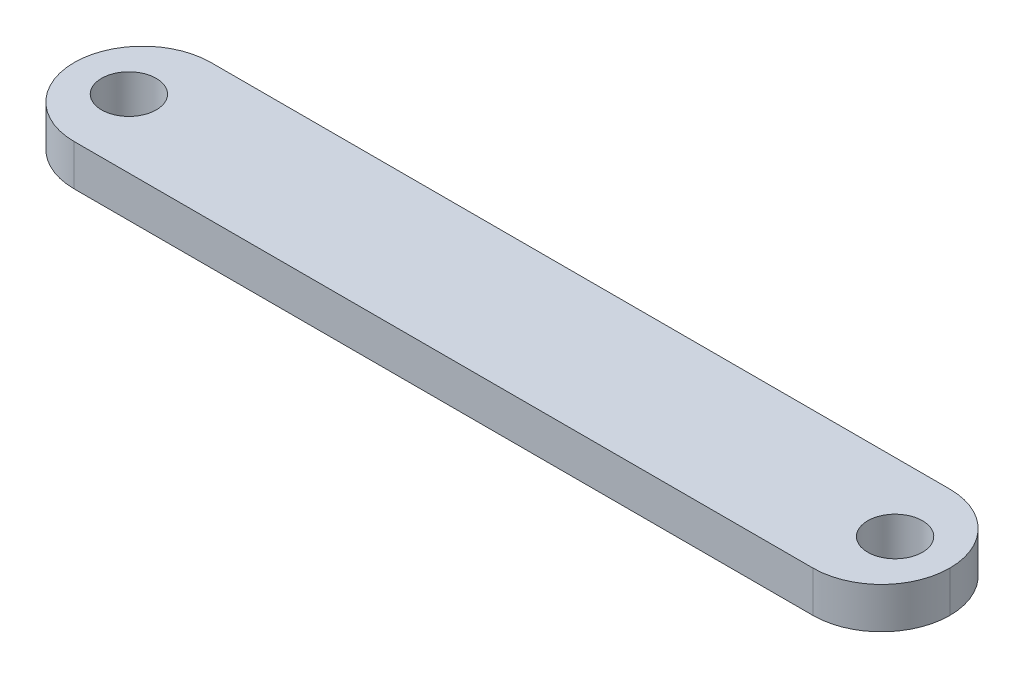
ISO-10303-21;
HEADER;
FILE_DESCRIPTION(('STEP AP214'),'2;1');
FILE_NAME('part.step','',(''),(''),'','','');
FILE_SCHEMA(('AUTOMOTIVE_DESIGN { 1 0 10303 214 1 1 1 1 }'));
ENDSEC;
DATA;
#1=APPLICATION_CONTEXT('core data for automotive mechanical design processes');
#2=APPLICATION_PROTOCOL_DEFINITION('international standard','automotive_design',2000,#1);
#3=PRODUCT_CONTEXT('',#1,'mechanical');
#4=PRODUCT('Part','Part','',(#3));
#5=PRODUCT_RELATED_PRODUCT_CATEGORY('part','',(#4));
#6=PRODUCT_DEFINITION_FORMATION('','',#4);
#7=PRODUCT_DEFINITION_CONTEXT('part definition',#1,'design');
#8=PRODUCT_DEFINITION('design','',#6,#7);
#9=PRODUCT_DEFINITION_SHAPE('','',#8);
#10=(LENGTH_UNIT() NAMED_UNIT(*) SI_UNIT(.MILLI.,.METRE.));
#11=(NAMED_UNIT(*) PLANE_ANGLE_UNIT() SI_UNIT($,.RADIAN.));
#12=(NAMED_UNIT(*) SI_UNIT($,.STERADIAN.) SOLID_ANGLE_UNIT());
#13=UNCERTAINTY_MEASURE_WITH_UNIT(LENGTH_MEASURE(1.E-05),#10,'distance_accuracy_value','');
#14=(GEOMETRIC_REPRESENTATION_CONTEXT(3) GLOBAL_UNCERTAINTY_ASSIGNED_CONTEXT((#13)) GLOBAL_UNIT_ASSIGNED_CONTEXT((#10,
#11,#12)) REPRESENTATION_CONTEXT('',''));
#15=CARTESIAN_POINT('',(0.,0.,0.));
#16=DIRECTION('',(0.,0.,1.));
#17=DIRECTION('',(1.,0.,0.));
#18=AXIS2_PLACEMENT_3D('',#15,#16,#17);
#19=CARTESIAN_POINT('',(0.,9.525,0.));
#20=DIRECTION('',(0.,-1.,0.));
#21=DIRECTION('',(0.,0.,-1.));
#22=AXIS2_PLACEMENT_3D('',#19,#20,#21);
#23=PLANE('',#22);
#24=CARTESIAN_POINT('',(187.325,9.525,-15.875));
#25=DIRECTION('',(0.,-1.,0.));
#26=DIRECTION('',(0.,0.,-1.));
#27=AXIS2_PLACEMENT_3D('',#24,#25,#26);
#28=CIRCLE('',#27,15.875);
#29=CARTESIAN_POINT('',(187.325,9.525,0.));
#30=VERTEX_POINT('',#29);
#31=CARTESIAN_POINT('',(203.2,9.525,-15.875));
#32=VERTEX_POINT('',#31);
#33=EDGE_CURVE('E57',#30,#32,#28,.F.);
#34=ORIENTED_EDGE('',*,*,#33,.T.);
#35=CARTESIAN_POINT('',(187.325,9.525,-15.875));
#36=DIRECTION('',(0.,-1.,0.));
#37=DIRECTION('',(0.,0.,-1.));
#38=AXIS2_PLACEMENT_3D('',#35,#36,#37);
#39=CIRCLE('',#38,15.875);
#40=CARTESIAN_POINT('',(187.325,9.525,-31.75));
#41=VERTEX_POINT('',#40);
#42=EDGE_CURVE('E151',#32,#41,#39,.F.);
#43=ORIENTED_EDGE('',*,*,#42,.T.);
#44=DIRECTION('',(-1.,0.,0.));
#45=VECTOR('',#44,1.);
#46=CARTESIAN_POINT('',(0.,9.525,-31.7499999999999));
#47=LINE('',#46,#45);
#48=CARTESIAN_POINT('',(15.875,9.525,-31.7499999999999));
#49=VERTEX_POINT('',#48);
#50=EDGE_CURVE('E116',#41,#49,#47,.T.);
#51=ORIENTED_EDGE('',*,*,#50,.T.);
#52=CARTESIAN_POINT('',(15.875,9.525,-15.8749999999999));
#53=DIRECTION('',(0.,-1.,0.));
#54=DIRECTION('',(0.,0.,-1.));
#55=AXIS2_PLACEMENT_3D('',#52,#53,#54);
#56=CIRCLE('',#55,15.875);
#57=CARTESIAN_POINT('',(0.,9.525,-15.875));
#58=VERTEX_POINT('',#57);
#59=EDGE_CURVE('E146',#49,#58,#56,.F.);
#60=ORIENTED_EDGE('',*,*,#59,.T.);
#61=CARTESIAN_POINT('',(15.875,9.525,-15.875));
#62=DIRECTION('',(0.,-1.,0.));
#63=DIRECTION('',(0.,0.,-1.));
#64=AXIS2_PLACEMENT_3D('',#61,#62,#63);
#65=CIRCLE('',#64,15.875);
#66=CARTESIAN_POINT('',(15.875,9.525,0.));
#67=VERTEX_POINT('',#66);
#68=EDGE_CURVE('E105',#58,#67,#65,.F.);
#69=ORIENTED_EDGE('',*,*,#68,.T.);
#70=DIRECTION('',(1.,0.,0.));
#71=VECTOR('',#70,1.);
#72=CARTESIAN_POINT('',(0.,9.525,0.));
#73=LINE('',#72,#71);
#74=EDGE_CURVE('E126',#67,#30,#73,.T.);
#75=ORIENTED_EDGE('',*,*,#74,.T.);
#76=EDGE_LOOP('',(#34,#43,#51,#60,#69,#75));
#77=FACE_BOUND('',#76,.T.);
#78=CARTESIAN_POINT('',(12.7,9.525,-15.875));
#79=DIRECTION('',(0.,1.,0.));
#80=DIRECTION('',(0.,0.,1.));
#81=AXIS2_PLACEMENT_3D('',#78,#79,#80);
#82=CIRCLE('',#81,6.35);
#83=CARTESIAN_POINT('',(12.7,9.525,-22.225));
#84=VERTEX_POINT('',#83);
#85=EDGE_CURVE('E132',#84,#84,#82,.T.);
#86=ORIENTED_EDGE('',*,*,#85,.F.);
#87=EDGE_LOOP('',(#86));
#88=FACE_BOUND('',#87,.T.);
#89=CARTESIAN_POINT('',(190.5,9.525,-15.875));
#90=DIRECTION('',(0.,1.,0.));
#91=DIRECTION('',(0.,0.,1.));
#92=AXIS2_PLACEMENT_3D('',#89,#90,#91);
#93=CIRCLE('',#92,6.35);
#94=CARTESIAN_POINT('',(190.5,9.525,-22.225));
#95=VERTEX_POINT('',#94);
#96=EDGE_CURVE('E160',#95,#95,#93,.T.);
#97=ORIENTED_EDGE('',*,*,#96,.F.);
#98=EDGE_LOOP('',(#97));
#99=FACE_BOUND('',#98,.T.);
#100=ADVANCED_FACE('F39',(#77,#88,#99),#23,.F.);
#101=CARTESIAN_POINT('',(0.,0.,0.));
#102=DIRECTION('',(0.,-1.,0.));
#103=DIRECTION('',(0.,0.,-1.));
#104=AXIS2_PLACEMENT_3D('',#101,#102,#103);
#105=PLANE('',#104);
#106=CARTESIAN_POINT('',(12.7,0.,-15.875));
#107=DIRECTION('',(0.,1.,0.));
#108=DIRECTION('',(0.,0.,1.));
#109=AXIS2_PLACEMENT_3D('',#106,#107,#108);
#110=CIRCLE('',#109,6.35);
#111=CARTESIAN_POINT('',(12.7,0.,-22.225));
#112=VERTEX_POINT('',#111);
#113=EDGE_CURVE('E177',#112,#112,#110,.T.);
#114=ORIENTED_EDGE('',*,*,#113,.T.);
#115=EDGE_LOOP('',(#114));
#116=FACE_BOUND('',#115,.T.);
#117=DIRECTION('',(-1.,0.,0.));
#118=VECTOR('',#117,1.);
#119=CARTESIAN_POINT('',(0.,0.,-31.7499999999999));
#120=LINE('',#119,#118);
#121=CARTESIAN_POINT('',(187.325,0.,-31.75));
#122=VERTEX_POINT('',#121);
#123=CARTESIAN_POINT('',(15.875,0.,-31.7499999999999));
#124=VERTEX_POINT('',#123);
#125=EDGE_CURVE('E113',#122,#124,#120,.T.);
#126=ORIENTED_EDGE('',*,*,#125,.F.);
#127=CARTESIAN_POINT('',(187.325,0.,-15.875));
#128=DIRECTION('',(0.,-1.,0.));
#129=DIRECTION('',(0.,0.,-1.));
#130=AXIS2_PLACEMENT_3D('',#127,#128,#129);
#131=CIRCLE('',#130,15.875);
#132=CARTESIAN_POINT('',(203.2,0.,-15.875));
#133=VERTEX_POINT('',#132);
#134=EDGE_CURVE('E95',#122,#133,#131,.T.);
#135=ORIENTED_EDGE('',*,*,#134,.T.);
#136=CARTESIAN_POINT('',(187.325,0.,-15.875));
#137=DIRECTION('',(0.,-1.,0.));
#138=DIRECTION('',(0.,0.,-1.));
#139=AXIS2_PLACEMENT_3D('',#136,#137,#138);
#140=CIRCLE('',#139,15.875);
#141=CARTESIAN_POINT('',(187.325,0.,0.));
#142=VERTEX_POINT('',#141);
#143=EDGE_CURVE('E106',#133,#142,#140,.T.);
#144=ORIENTED_EDGE('',*,*,#143,.T.);
#145=DIRECTION('',(1.,0.,0.));
#146=VECTOR('',#145,1.);
#147=CARTESIAN_POINT('',(0.,0.,0.));
#148=LINE('',#147,#146);
#149=CARTESIAN_POINT('',(15.875,0.,0.));
#150=VERTEX_POINT('',#149);
#151=EDGE_CURVE('E127',#150,#142,#148,.T.);
#152=ORIENTED_EDGE('',*,*,#151,.F.);
#153=CARTESIAN_POINT('',(15.875,0.,-15.875));
#154=DIRECTION('',(0.,-1.,0.));
#155=DIRECTION('',(0.,0.,-1.));
#156=AXIS2_PLACEMENT_3D('',#153,#154,#155);
#157=CIRCLE('',#156,15.875);
#158=CARTESIAN_POINT('',(0.,0.,-15.875));
#159=VERTEX_POINT('',#158);
#160=EDGE_CURVE('E118',#150,#159,#157,.T.);
#161=ORIENTED_EDGE('',*,*,#160,.T.);
#162=CARTESIAN_POINT('',(15.875,0.,-15.8749999999999));
#163=DIRECTION('',(0.,-1.,0.));
#164=DIRECTION('',(0.,0.,-1.));
#165=AXIS2_PLACEMENT_3D('',#162,#163,#164);
#166=CIRCLE('',#165,15.875);
#167=EDGE_CURVE('E124',#159,#124,#166,.T.);
#168=ORIENTED_EDGE('',*,*,#167,.T.);
#169=EDGE_LOOP('',(#126,#135,#144,#152,#161,#168));
#170=FACE_BOUND('',#169,.T.);
#171=CARTESIAN_POINT('',(190.5,0.,-15.875));
#172=DIRECTION('',(0.,1.,0.));
#173=DIRECTION('',(0.,0.,1.));
#174=AXIS2_PLACEMENT_3D('',#171,#172,#173);
#175=CIRCLE('',#174,6.35);
#176=CARTESIAN_POINT('',(190.5,0.,-22.225));
#177=VERTEX_POINT('',#176);
#178=EDGE_CURVE('E156',#177,#177,#175,.T.);
#179=ORIENTED_EDGE('',*,*,#178,.T.);
#180=EDGE_LOOP('',(#179));
#181=FACE_BOUND('',#180,.T.);
#182=ADVANCED_FACE('F121',(#116,#170,#181),#105,.T.);
#183=CARTESIAN_POINT('',(0.,9.525,0.));
#184=DIRECTION('',(0.,0.,-1.));
#185=DIRECTION('',(-1.,0.,0.));
#186=AXIS2_PLACEMENT_3D('',#183,#184,#185);
#187=PLANE('',#186);
#188=ORIENTED_EDGE('',*,*,#151,.T.);
#189=DIRECTION('',(0.,-1.,0.));
#190=VECTOR('',#189,1.);
#191=CARTESIAN_POINT('',(187.325,9.525,0.));
#192=LINE('',#191,#190);
#193=EDGE_CURVE('E11',#142,#30,#192,.F.);
#194=ORIENTED_EDGE('',*,*,#193,.T.);
#195=ORIENTED_EDGE('',*,*,#74,.F.);
#196=DIRECTION('',(0.,-1.,0.));
#197=VECTOR('',#196,1.);
#198=CARTESIAN_POINT('',(15.875,9.525,0.));
#199=LINE('',#198,#197);
#200=EDGE_CURVE('E49',#67,#150,#199,.T.);
#201=ORIENTED_EDGE('',*,*,#200,.T.);
#202=EDGE_LOOP('',(#188,#194,#195,#201));
#203=FACE_BOUND('',#202,.T.);
#204=ADVANCED_FACE('F171',(#203),#187,.F.);
#205=CARTESIAN_POINT('',(0.,9.525,-31.7499999999999));
#206=DIRECTION('',(0.,0.,1.));
#207=DIRECTION('',(1.,0.,0.));
#208=AXIS2_PLACEMENT_3D('',#205,#206,#207);
#209=PLANE('',#208);
#210=ORIENTED_EDGE('',*,*,#50,.F.);
#211=DIRECTION('',(0.,-1.,0.));
#212=VECTOR('',#211,1.);
#213=CARTESIAN_POINT('',(187.325,9.525,-31.75));
#214=LINE('',#213,#212);
#215=EDGE_CURVE('E99',#41,#122,#214,.T.);
#216=ORIENTED_EDGE('',*,*,#215,.T.);
#217=ORIENTED_EDGE('',*,*,#125,.T.);
#218=DIRECTION('',(0.,-1.,0.));
#219=VECTOR('',#218,1.);
#220=CARTESIAN_POINT('',(15.875,9.525,-31.7499999999999));
#221=LINE('',#220,#219);
#222=EDGE_CURVE('E119',#124,#49,#221,.F.);
#223=ORIENTED_EDGE('',*,*,#222,.T.);
#224=EDGE_LOOP('',(#210,#216,#217,#223));
#225=FACE_BOUND('',#224,.T.);
#226=ADVANCED_FACE('F111',(#225),#209,.F.);
#227=CARTESIAN_POINT('',(12.7,9.525,-15.875));
#228=DIRECTION('',(0.,-1.,0.));
#229=DIRECTION('',(0.,0.,-1.));
#230=AXIS2_PLACEMENT_3D('',#227,#228,#229);
#231=CYLINDRICAL_SURFACE('',#230,6.35);
#232=CARTESIAN_POINT('',(12.7,9.525,-22.225));
#233=CARTESIAN_POINT('',(12.7,9.42578125,-22.225));
#234=CARTESIAN_POINT('',(12.7,9.3265625,-22.225));
#235=CARTESIAN_POINT('',(12.7,9.128125,-22.225));
#236=CARTESIAN_POINT('',(12.7,9.02890625,-22.225));
#237=CARTESIAN_POINT('',(12.7,8.83046875,-22.225));
#238=CARTESIAN_POINT('',(12.7,8.73125,-22.225));
#239=CARTESIAN_POINT('',(12.7,8.5328125,-22.225));
#240=CARTESIAN_POINT('',(12.7,8.43359375,-22.225));
#241=CARTESIAN_POINT('',(12.7,8.23515625,-22.225));
#242=CARTESIAN_POINT('',(12.7,8.1359375,-22.225));
#243=CARTESIAN_POINT('',(12.7,7.9375,-22.225));
#244=CARTESIAN_POINT('',(12.7,7.83828125,-22.225));
#245=CARTESIAN_POINT('',(12.7,7.63984375,-22.225));
#246=CARTESIAN_POINT('',(12.7,7.540625,-22.225));
#247=CARTESIAN_POINT('',(12.7,7.3421875,-22.225));
#248=CARTESIAN_POINT('',(12.7,7.24296875,-22.225));
#249=CARTESIAN_POINT('',(12.7,7.04453125,-22.225));
#250=CARTESIAN_POINT('',(12.7,6.9453125,-22.225));
#251=CARTESIAN_POINT('',(12.7,6.746875,-22.225));
#252=CARTESIAN_POINT('',(12.7,6.64765625,-22.225));
#253=CARTESIAN_POINT('',(12.7,6.44921875,-22.225));
#254=CARTESIAN_POINT('',(12.7,6.35,-22.225));
#255=CARTESIAN_POINT('',(12.7,6.1515625,-22.225));
#256=CARTESIAN_POINT('',(12.7,6.05234375,-22.225));
#257=CARTESIAN_POINT('',(12.7,5.85390625,-22.225));
#258=CARTESIAN_POINT('',(12.7,5.7546875,-22.225));
#259=CARTESIAN_POINT('',(12.7,5.55625,-22.225));
#260=CARTESIAN_POINT('',(12.7,5.45703125,-22.225));
#261=CARTESIAN_POINT('',(12.7,5.25859375,-22.225));
#262=CARTESIAN_POINT('',(12.7,5.159375,-22.225));
#263=CARTESIAN_POINT('',(12.7,4.9609375,-22.225));
#264=CARTESIAN_POINT('',(12.7,4.86171875,-22.225));
#265=CARTESIAN_POINT('',(12.7,4.66328125,-22.225));
#266=CARTESIAN_POINT('',(12.7,4.5640625,-22.225));
#267=CARTESIAN_POINT('',(12.7,4.365625,-22.225));
#268=CARTESIAN_POINT('',(12.7,4.26640625,-22.225));
#269=CARTESIAN_POINT('',(12.7,4.06796875,-22.225));
#270=CARTESIAN_POINT('',(12.7,3.96875,-22.225));
#271=CARTESIAN_POINT('',(12.7,3.7703125,-22.225));
#272=CARTESIAN_POINT('',(12.7,3.67109375,-22.225));
#273=CARTESIAN_POINT('',(12.7,3.47265625,-22.225));
#274=CARTESIAN_POINT('',(12.7,3.3734375,-22.225));
#275=CARTESIAN_POINT('',(12.7,3.175,-22.225));
#276=CARTESIAN_POINT('',(12.7,3.07578125,-22.225));
#277=CARTESIAN_POINT('',(12.7,2.87734375,-22.225));
#278=CARTESIAN_POINT('',(12.7,2.778125,-22.225));
#279=CARTESIAN_POINT('',(12.7,2.5796875,-22.225));
#280=CARTESIAN_POINT('',(12.7,2.48046875,-22.225));
#281=CARTESIAN_POINT('',(12.7,2.28203125,-22.225));
#282=CARTESIAN_POINT('',(12.7,2.1828125,-22.225));
#283=CARTESIAN_POINT('',(12.7,1.984375,-22.225));
#284=CARTESIAN_POINT('',(12.7,1.88515625,-22.225));
#285=CARTESIAN_POINT('',(12.7,1.68671875,-22.225));
#286=CARTESIAN_POINT('',(12.7,1.5875,-22.225));
#287=CARTESIAN_POINT('',(12.7,1.3890625,-22.225));
#288=CARTESIAN_POINT('',(12.7,1.28984375,-22.225));
#289=CARTESIAN_POINT('',(12.7,1.09140625,-22.225));
#290=CARTESIAN_POINT('',(12.7,0.992187500000001,-22.225));
#291=CARTESIAN_POINT('',(12.7,0.793750000000001,-22.225));
#292=CARTESIAN_POINT('',(12.7,0.69453125,-22.225));
#293=CARTESIAN_POINT('',(12.7,0.49609375,-22.225));
#294=CARTESIAN_POINT('',(12.7,0.396875,-22.225));
#295=CARTESIAN_POINT('',(12.7,0.1984375,-22.225));
#296=CARTESIAN_POINT('',(12.7,0.0992187500000001,-22.225));
#297=CARTESIAN_POINT('',(12.7,0.,-22.225));
#298=B_SPLINE_CURVE_WITH_KNOTS('',3,(#232,#233,#234,#235,#236,#237,#238,#239,#240,#241,#242,
#243,#244,#245,#246,#247,#248,#249,#250,#251,#252,#253,#254,#255,#256,#257,#258,#259,#260,#261,
#262,#263,#264,#265,#266,#267,#268,#269,#270,#271,#272,#273,#274,#275,#276,#277,#278,#279,#280,
#281,#282,#283,#284,#285,#286,#287,#288,#289,#290,#291,#292,#293,#294,#295,#296,#297),
.UNSPECIFIED.,.F.,.F.,(4,2,2,2,2,2,2,2,2,2,2,2,2,2,2,2,2,2,2,2,2,2,2,2,2,2,2,2,2,2,2,2,4),(0.,
0.297656249999998,0.595312499999999,0.892968749999999,1.190625,1.48828125,1.7859375,2.08359375,
2.38125,2.67890625,2.9765625,3.27421875,3.571875,3.86953125,4.1671875,4.46484375,4.7625,
5.06015625,5.3578125,5.65546875,5.953125,6.25078125,6.5484375,6.84609375,7.14375,7.44140625,
7.7390625,8.03671875,8.334375,8.63203125,8.9296875,9.22734375,9.525),.UNSPECIFIED.);
#299=EDGE_CURVE('BSEAM199',#84,#112,#298,.T.);
#300=ORIENTED_EDGE('',*,*,#85,.T.);
#301=ORIENTED_EDGE('',*,*,#113,.F.);
#302=ORIENTED_EDGE('',*,*,#299,.T.);
#303=ORIENTED_EDGE('',*,*,#299,.F.);
#304=EDGE_LOOP('',(#300,#302,#301,#303));
#305=FACE_BOUND('',#304,.T.);
#306=ADVANCED_FACE('F199',(#305),#231,.F.);
#307=CARTESIAN_POINT('',(190.5,9.525,-15.875));
#308=DIRECTION('',(0.,-1.,0.));
#309=DIRECTION('',(0.,0.,-1.));
#310=AXIS2_PLACEMENT_3D('',#307,#308,#309);
#311=CYLINDRICAL_SURFACE('',#310,6.35);
#312=CARTESIAN_POINT('',(190.5,9.525,-22.225));
#313=CARTESIAN_POINT('',(190.5,9.42578125,-22.225));
#314=CARTESIAN_POINT('',(190.5,9.3265625,-22.225));
#315=CARTESIAN_POINT('',(190.5,9.128125,-22.225));
#316=CARTESIAN_POINT('',(190.5,9.02890625,-22.225));
#317=CARTESIAN_POINT('',(190.5,8.83046875,-22.225));
#318=CARTESIAN_POINT('',(190.5,8.73125,-22.225));
#319=CARTESIAN_POINT('',(190.5,8.5328125,-22.225));
#320=CARTESIAN_POINT('',(190.5,8.43359375,-22.225));
#321=CARTESIAN_POINT('',(190.5,8.23515625,-22.225));
#322=CARTESIAN_POINT('',(190.5,8.1359375,-22.225));
#323=CARTESIAN_POINT('',(190.5,7.9375,-22.225));
#324=CARTESIAN_POINT('',(190.5,7.83828125,-22.225));
#325=CARTESIAN_POINT('',(190.5,7.63984375,-22.225));
#326=CARTESIAN_POINT('',(190.5,7.540625,-22.225));
#327=CARTESIAN_POINT('',(190.5,7.3421875,-22.225));
#328=CARTESIAN_POINT('',(190.5,7.24296875,-22.225));
#329=CARTESIAN_POINT('',(190.5,7.04453125,-22.225));
#330=CARTESIAN_POINT('',(190.5,6.9453125,-22.225));
#331=CARTESIAN_POINT('',(190.5,6.746875,-22.225));
#332=CARTESIAN_POINT('',(190.5,6.64765625,-22.225));
#333=CARTESIAN_POINT('',(190.5,6.44921875,-22.225));
#334=CARTESIAN_POINT('',(190.5,6.35,-22.225));
#335=CARTESIAN_POINT('',(190.5,6.1515625,-22.225));
#336=CARTESIAN_POINT('',(190.5,6.05234375,-22.225));
#337=CARTESIAN_POINT('',(190.5,5.85390625,-22.225));
#338=CARTESIAN_POINT('',(190.5,5.7546875,-22.225));
#339=CARTESIAN_POINT('',(190.5,5.55625,-22.225));
#340=CARTESIAN_POINT('',(190.5,5.45703125,-22.225));
#341=CARTESIAN_POINT('',(190.5,5.25859375,-22.225));
#342=CARTESIAN_POINT('',(190.5,5.159375,-22.225));
#343=CARTESIAN_POINT('',(190.5,4.9609375,-22.225));
#344=CARTESIAN_POINT('',(190.5,4.86171875,-22.225));
#345=CARTESIAN_POINT('',(190.5,4.66328125,-22.225));
#346=CARTESIAN_POINT('',(190.5,4.5640625,-22.225));
#347=CARTESIAN_POINT('',(190.5,4.365625,-22.225));
#348=CARTESIAN_POINT('',(190.5,4.26640625,-22.225));
#349=CARTESIAN_POINT('',(190.5,4.06796875,-22.225));
#350=CARTESIAN_POINT('',(190.5,3.96875,-22.225));
#351=CARTESIAN_POINT('',(190.5,3.7703125,-22.225));
#352=CARTESIAN_POINT('',(190.5,3.67109375,-22.225));
#353=CARTESIAN_POINT('',(190.5,3.47265625,-22.225));
#354=CARTESIAN_POINT('',(190.5,3.3734375,-22.225));
#355=CARTESIAN_POINT('',(190.5,3.175,-22.225));
#356=CARTESIAN_POINT('',(190.5,3.07578125,-22.225));
#357=CARTESIAN_POINT('',(190.5,2.87734375,-22.225));
#358=CARTESIAN_POINT('',(190.5,2.778125,-22.225));
#359=CARTESIAN_POINT('',(190.5,2.5796875,-22.225));
#360=CARTESIAN_POINT('',(190.5,2.48046875,-22.225));
#361=CARTESIAN_POINT('',(190.5,2.28203125,-22.225));
#362=CARTESIAN_POINT('',(190.5,2.1828125,-22.225));
#363=CARTESIAN_POINT('',(190.5,1.984375,-22.225));
#364=CARTESIAN_POINT('',(190.5,1.88515625,-22.225));
#365=CARTESIAN_POINT('',(190.5,1.68671875,-22.225));
#366=CARTESIAN_POINT('',(190.5,1.5875,-22.225));
#367=CARTESIAN_POINT('',(190.5,1.3890625,-22.225));
#368=CARTESIAN_POINT('',(190.5,1.28984375,-22.225));
#369=CARTESIAN_POINT('',(190.5,1.09140625,-22.225));
#370=CARTESIAN_POINT('',(190.5,0.992187500000001,-22.225));
#371=CARTESIAN_POINT('',(190.5,0.793750000000001,-22.225));
#372=CARTESIAN_POINT('',(190.5,0.69453125,-22.225));
#373=CARTESIAN_POINT('',(190.5,0.49609375,-22.225));
#374=CARTESIAN_POINT('',(190.5,0.396875,-22.225));
#375=CARTESIAN_POINT('',(190.5,0.1984375,-22.225));
#376=CARTESIAN_POINT('',(190.5,0.0992187500000001,-22.225));
#377=CARTESIAN_POINT('',(190.5,0.,-22.225));
#378=B_SPLINE_CURVE_WITH_KNOTS('',3,(#312,#313,#314,#315,#316,#317,#318,#319,#320,#321,#322,
#323,#324,#325,#326,#327,#328,#329,#330,#331,#332,#333,#334,#335,#336,#337,#338,#339,#340,#341,
#342,#343,#344,#345,#346,#347,#348,#349,#350,#351,#352,#353,#354,#355,#356,#357,#358,#359,#360,
#361,#362,#363,#364,#365,#366,#367,#368,#369,#370,#371,#372,#373,#374,#375,#376,#377),
.UNSPECIFIED.,.F.,.F.,(4,2,2,2,2,2,2,2,2,2,2,2,2,2,2,2,2,2,2,2,2,2,2,2,2,2,2,2,2,2,2,2,4),(0.,
0.297656249999998,0.595312499999999,0.892968749999999,1.190625,1.48828125,1.7859375,2.08359375,
2.38125,2.67890625,2.9765625,3.27421875,3.571875,3.86953125,4.1671875,4.46484375,4.7625,
5.06015625,5.3578125,5.65546875,5.953125,6.25078125,6.5484375,6.84609375,7.14375,7.44140625,
7.7390625,8.03671875,8.334375,8.63203125,8.9296875,9.22734375,9.525),.UNSPECIFIED.);
#379=EDGE_CURVE('BSEAM188',#95,#177,#378,.T.);
#380=ORIENTED_EDGE('',*,*,#96,.T.);
#381=ORIENTED_EDGE('',*,*,#178,.F.);
#382=ORIENTED_EDGE('',*,*,#379,.T.);
#383=ORIENTED_EDGE('',*,*,#379,.F.);
#384=EDGE_LOOP('',(#380,#382,#381,#383));
#385=FACE_BOUND('',#384,.T.);
#386=ADVANCED_FACE('F188',(#385),#311,.F.);
#387=CARTESIAN_POINT('',(187.325,9.525,-15.875));
#388=DIRECTION('',(0.,-1.,0.));
#389=DIRECTION('',(0.,0.,-1.));
#390=AXIS2_PLACEMENT_3D('',#387,#388,#389);
#391=CYLINDRICAL_SURFACE('',#390,15.875);
#392=DIRECTION('',(0.,-1.,0.));
#393=VECTOR('',#392,1.);
#394=CARTESIAN_POINT('',(203.2,9.525,-15.875));
#395=LINE('',#394,#393);
#396=EDGE_CURVE('E100',#32,#133,#395,.T.);
#397=ORIENTED_EDGE('',*,*,#396,.F.);
#398=ORIENTED_EDGE('',*,*,#33,.F.);
#399=ORIENTED_EDGE('',*,*,#193,.F.);
#400=ORIENTED_EDGE('',*,*,#143,.F.);
#401=EDGE_LOOP('',(#397,#398,#399,#400));
#402=FACE_BOUND('',#401,.T.);
#403=ADVANCED_FACE('F174',(#402),#391,.T.);
#404=CARTESIAN_POINT('',(187.325,9.525,-15.875));
#405=DIRECTION('',(0.,-1.,0.));
#406=DIRECTION('',(0.,0.,-1.));
#407=AXIS2_PLACEMENT_3D('',#404,#405,#406);
#408=CYLINDRICAL_SURFACE('',#407,15.875);
#409=ORIENTED_EDGE('',*,*,#42,.F.);
#410=ORIENTED_EDGE('',*,*,#396,.T.);
#411=ORIENTED_EDGE('',*,*,#134,.F.);
#412=ORIENTED_EDGE('',*,*,#215,.F.);
#413=EDGE_LOOP('',(#409,#410,#411,#412));
#414=FACE_BOUND('',#413,.T.);
#415=ADVANCED_FACE('F98',(#414),#408,.T.);
#416=CARTESIAN_POINT('',(15.875,9.525,-15.875));
#417=DIRECTION('',(0.,-1.,0.));
#418=DIRECTION('',(0.,0.,-1.));
#419=AXIS2_PLACEMENT_3D('',#416,#417,#418);
#420=CYLINDRICAL_SURFACE('',#419,15.875);
#421=ORIENTED_EDGE('',*,*,#200,.F.);
#422=ORIENTED_EDGE('',*,*,#68,.F.);
#423=DIRECTION('',(0.,-1.,0.));
#424=VECTOR('',#423,1.);
#425=CARTESIAN_POINT('',(0.,9.525,-15.875));
#426=LINE('',#425,#424);
#427=EDGE_CURVE('E43',#159,#58,#426,.F.);
#428=ORIENTED_EDGE('',*,*,#427,.F.);
#429=ORIENTED_EDGE('',*,*,#160,.F.);
#430=EDGE_LOOP('',(#421,#422,#428,#429));
#431=FACE_BOUND('',#430,.T.);
#432=ADVANCED_FACE('F41',(#431),#420,.T.);
#433=CARTESIAN_POINT('',(15.875,9.525,-15.8749999999999));
#434=DIRECTION('',(0.,-1.,0.));
#435=DIRECTION('',(0.,0.,-1.));
#436=AXIS2_PLACEMENT_3D('',#433,#434,#435);
#437=CYLINDRICAL_SURFACE('',#436,15.875);
#438=ORIENTED_EDGE('',*,*,#59,.F.);
#439=ORIENTED_EDGE('',*,*,#222,.F.);
#440=ORIENTED_EDGE('',*,*,#167,.F.);
#441=ORIENTED_EDGE('',*,*,#427,.T.);
#442=EDGE_LOOP('',(#438,#439,#440,#441));
#443=FACE_BOUND('',#442,.T.);
#444=ADVANCED_FACE('F165',(#443),#437,.T.);
#445=CLOSED_SHELL('',(#100,#182,#204,#226,#306,#386,#403,#415,#432,#444));
#446=MANIFOLD_SOLID_BREP('B2',#445);
#447=ADVANCED_BREP_SHAPE_REPRESENTATION('',(#18,#446),#14);
#448=SHAPE_DEFINITION_REPRESENTATION(#9,#447);
ENDSEC;
END-ISO-10303-21;
